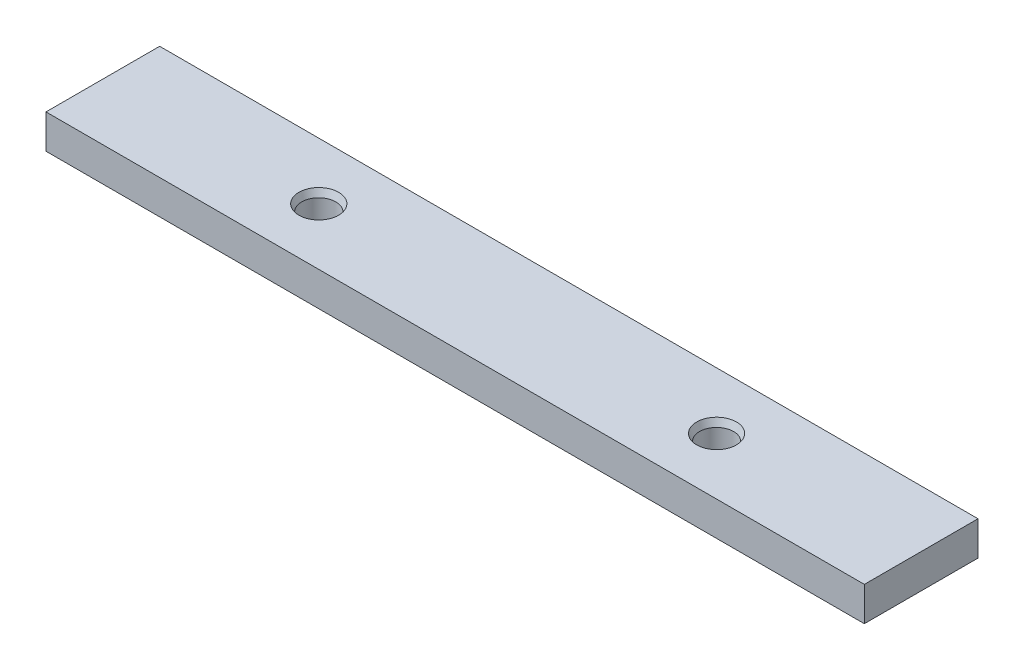
ISO-10303-21;
HEADER;
FILE_DESCRIPTION(('STEP AP214'),'2;1');
FILE_NAME('part.step','',(''),(''),'','','');
FILE_SCHEMA(('AUTOMOTIVE_DESIGN { 1 0 10303 214 1 1 1 1 }'));
ENDSEC;
DATA;
#1=APPLICATION_CONTEXT('core data for automotive mechanical design processes');
#2=APPLICATION_PROTOCOL_DEFINITION('international standard','automotive_design',2000,#1);
#3=PRODUCT_CONTEXT('',#1,'mechanical');
#4=PRODUCT('Part','Part','',(#3));
#5=PRODUCT_RELATED_PRODUCT_CATEGORY('part','',(#4));
#6=PRODUCT_DEFINITION_FORMATION('','',#4);
#7=PRODUCT_DEFINITION_CONTEXT('part definition',#1,'design');
#8=PRODUCT_DEFINITION('design','',#6,#7);
#9=PRODUCT_DEFINITION_SHAPE('','',#8);
#10=(LENGTH_UNIT() NAMED_UNIT(*) SI_UNIT(.MILLI.,.METRE.));
#11=(NAMED_UNIT(*) PLANE_ANGLE_UNIT() SI_UNIT($,.RADIAN.));
#12=(NAMED_UNIT(*) SI_UNIT($,.STERADIAN.) SOLID_ANGLE_UNIT());
#13=UNCERTAINTY_MEASURE_WITH_UNIT(LENGTH_MEASURE(1.E-05),#10,'distance_accuracy_value','');
#14=(GEOMETRIC_REPRESENTATION_CONTEXT(3) GLOBAL_UNCERTAINTY_ASSIGNED_CONTEXT((#13)) GLOBAL_UNIT_ASSIGNED_CONTEXT((#10,
#11,#12)) REPRESENTATION_CONTEXT('',''));
#15=CARTESIAN_POINT('',(0.,0.,0.));
#16=DIRECTION('',(0.,0.,1.));
#17=DIRECTION('',(1.,0.,0.));
#18=AXIS2_PLACEMENT_3D('',#15,#16,#17);
#19=CARTESIAN_POINT('',(0.,6.,0.));
#20=DIRECTION('',(0.,-1.,0.));
#21=DIRECTION('',(0.,0.,-1.));
#22=AXIS2_PLACEMENT_3D('',#19,#20,#21);
#23=PLANE('',#22);
#24=DIRECTION('',(0.,0.,1.));
#25=VECTOR('',#24,1.);
#26=CARTESIAN_POINT('',(0.,6.,0.));
#27=LINE('',#26,#25);
#28=CARTESIAN_POINT('',(0.,6.,-20.));
#29=VERTEX_POINT('',#28);
#30=CARTESIAN_POINT('',(0.,6.,0.));
#31=VERTEX_POINT('',#30);
#32=EDGE_CURVE('E96',#29,#31,#27,.T.);
#33=ORIENTED_EDGE('',*,*,#32,.T.);
#34=DIRECTION('',(1.,0.,0.));
#35=VECTOR('',#34,1.);
#36=CARTESIAN_POINT('',(0.,6.,0.));
#37=LINE('',#36,#35);
#38=CARTESIAN_POINT('',(144.,6.,0.));
#39=VERTEX_POINT('',#38);
#40=EDGE_CURVE('E91',#31,#39,#37,.T.);
#41=ORIENTED_EDGE('',*,*,#40,.T.);
#42=DIRECTION('',(0.,0.,-1.));
#43=VECTOR('',#42,1.);
#44=CARTESIAN_POINT('',(144.,6.,0.));
#45=LINE('',#44,#43);
#46=CARTESIAN_POINT('',(144.,6.,-20.));
#47=VERTEX_POINT('',#46);
#48=EDGE_CURVE('E94',#39,#47,#45,.T.);
#49=ORIENTED_EDGE('',*,*,#48,.T.);
#50=DIRECTION('',(-1.,0.,0.));
#51=VECTOR('',#50,1.);
#52=CARTESIAN_POINT('',(0.,6.,-20.));
#53=LINE('',#52,#51);
#54=EDGE_CURVE('E61',#47,#29,#53,.T.);
#55=ORIENTED_EDGE('',*,*,#54,.T.);
#56=EDGE_LOOP('',(#33,#41,#49,#55));
#57=FACE_BOUND('',#56,.T.);
#58=CARTESIAN_POINT('',(108.,6.,-10.));
#59=DIRECTION('',(0.,1.,0.));
#60=DIRECTION('',(0.,0.,1.));
#61=AXIS2_PLACEMENT_3D('',#58,#59,#60);
#62=CIRCLE('',#61,3.5);
#63=CARTESIAN_POINT('',(108.,6.,-6.5));
#64=VERTEX_POINT('',#63);
#65=EDGE_CURVE('E127',#64,#64,#62,.T.);
#66=ORIENTED_EDGE('',*,*,#65,.F.);
#67=EDGE_LOOP('',(#66));
#68=FACE_BOUND('',#67,.T.);
#69=CARTESIAN_POINT('',(38.,6.,-10.));
#70=DIRECTION('',(0.,1.,0.));
#71=DIRECTION('',(0.,0.,1.));
#72=AXIS2_PLACEMENT_3D('',#69,#70,#71);
#73=CIRCLE('',#72,3.5);
#74=CARTESIAN_POINT('',(38.,6.,-6.5));
#75=VERTEX_POINT('',#74);
#76=EDGE_CURVE('E136',#75,#75,#73,.T.);
#77=ORIENTED_EDGE('',*,*,#76,.F.);
#78=EDGE_LOOP('',(#77));
#79=FACE_BOUND('',#78,.T.);
#80=ADVANCED_FACE('F44',(#57,#68,#79),#23,.F.);
#81=CARTESIAN_POINT('',(0.,6.,0.));
#82=DIRECTION('',(1.,0.,0.));
#83=DIRECTION('',(0.,0.,-1.));
#84=AXIS2_PLACEMENT_3D('',#81,#82,#83);
#85=PLANE('',#84);
#86=DIRECTION('',(0.,0.,1.));
#87=VECTOR('',#86,1.);
#88=CARTESIAN_POINT('',(0.,0.,0.));
#89=LINE('',#88,#87);
#90=CARTESIAN_POINT('',(0.,0.,-20.));
#91=VERTEX_POINT('',#90);
#92=CARTESIAN_POINT('',(0.,0.,0.));
#93=VERTEX_POINT('',#92);
#94=EDGE_CURVE('E108',#91,#93,#89,.T.);
#95=ORIENTED_EDGE('',*,*,#94,.T.);
#96=DIRECTION('',(0.,-1.,0.));
#97=VECTOR('',#96,1.);
#98=CARTESIAN_POINT('',(0.,6.,0.));
#99=LINE('',#98,#97);
#100=EDGE_CURVE('E13',#31,#93,#99,.T.);
#101=ORIENTED_EDGE('',*,*,#100,.F.);
#102=ORIENTED_EDGE('',*,*,#32,.F.);
#103=DIRECTION('',(0.,-1.,0.));
#104=VECTOR('',#103,1.);
#105=CARTESIAN_POINT('',(0.,6.,-20.));
#106=LINE('',#105,#104);
#107=EDGE_CURVE('E104',#29,#91,#106,.T.);
#108=ORIENTED_EDGE('',*,*,#107,.T.);
#109=EDGE_LOOP('',(#95,#101,#102,#108));
#110=FACE_BOUND('',#109,.T.);
#111=ADVANCED_FACE('F46',(#110),#85,.F.);
#112=CARTESIAN_POINT('',(0.,6.,0.));
#113=DIRECTION('',(0.,0.,-1.));
#114=DIRECTION('',(-1.,0.,0.));
#115=AXIS2_PLACEMENT_3D('',#112,#113,#114);
#116=PLANE('',#115);
#117=DIRECTION('',(1.,0.,0.));
#118=VECTOR('',#117,1.);
#119=CARTESIAN_POINT('',(0.,0.,0.));
#120=LINE('',#119,#118);
#121=CARTESIAN_POINT('',(144.,0.,0.));
#122=VERTEX_POINT('',#121);
#123=EDGE_CURVE('E100',#93,#122,#120,.T.);
#124=ORIENTED_EDGE('',*,*,#123,.T.);
#125=DIRECTION('',(0.,-1.,0.));
#126=VECTOR('',#125,1.);
#127=CARTESIAN_POINT('',(144.,6.,0.));
#128=LINE('',#127,#126);
#129=EDGE_CURVE('E53',#39,#122,#128,.T.);
#130=ORIENTED_EDGE('',*,*,#129,.F.);
#131=ORIENTED_EDGE('',*,*,#40,.F.);
#132=ORIENTED_EDGE('',*,*,#100,.T.);
#133=EDGE_LOOP('',(#124,#130,#131,#132));
#134=FACE_BOUND('',#133,.T.);
#135=ADVANCED_FACE('F99',(#134),#116,.F.);
#136=CARTESIAN_POINT('',(144.,6.,0.));
#137=DIRECTION('',(-1.,0.,0.));
#138=DIRECTION('',(0.,0.,1.));
#139=AXIS2_PLACEMENT_3D('',#136,#137,#138);
#140=PLANE('',#139);
#141=DIRECTION('',(0.,0.,-1.));
#142=VECTOR('',#141,1.);
#143=CARTESIAN_POINT('',(144.,0.,0.));
#144=LINE('',#143,#142);
#145=CARTESIAN_POINT('',(144.,0.,-20.));
#146=VERTEX_POINT('',#145);
#147=EDGE_CURVE('E78',#122,#146,#144,.T.);
#148=ORIENTED_EDGE('',*,*,#147,.T.);
#149=DIRECTION('',(0.,-1.,0.));
#150=VECTOR('',#149,1.);
#151=CARTESIAN_POINT('',(144.,6.,-20.));
#152=LINE('',#151,#150);
#153=EDGE_CURVE('E101',#47,#146,#152,.T.);
#154=ORIENTED_EDGE('',*,*,#153,.F.);
#155=ORIENTED_EDGE('',*,*,#48,.F.);
#156=ORIENTED_EDGE('',*,*,#129,.T.);
#157=EDGE_LOOP('',(#148,#154,#155,#156));
#158=FACE_BOUND('',#157,.T.);
#159=ADVANCED_FACE('F102',(#158),#140,.F.);
#160=CARTESIAN_POINT('',(0.,6.,-20.));
#161=DIRECTION('',(0.,0.,1.));
#162=DIRECTION('',(1.,0.,0.));
#163=AXIS2_PLACEMENT_3D('',#160,#161,#162);
#164=PLANE('',#163);
#165=DIRECTION('',(-1.,0.,0.));
#166=VECTOR('',#165,1.);
#167=CARTESIAN_POINT('',(0.,0.,-20.));
#168=LINE('',#167,#166);
#169=EDGE_CURVE('E84',#146,#91,#168,.T.);
#170=ORIENTED_EDGE('',*,*,#169,.T.);
#171=ORIENTED_EDGE('',*,*,#107,.F.);
#172=ORIENTED_EDGE('',*,*,#54,.F.);
#173=ORIENTED_EDGE('',*,*,#153,.T.);
#174=EDGE_LOOP('',(#170,#171,#172,#173));
#175=FACE_BOUND('',#174,.T.);
#176=ADVANCED_FACE('F116',(#175),#164,.F.);
#177=CARTESIAN_POINT('',(0.,0.,0.));
#178=DIRECTION('',(0.,-1.,0.));
#179=DIRECTION('',(0.,0.,-1.));
#180=AXIS2_PLACEMENT_3D('',#177,#178,#179);
#181=PLANE('',#180);
#182=CARTESIAN_POINT('',(38.,0.,-10.));
#183=DIRECTION('',(0.,-1.,0.));
#184=DIRECTION('',(0.,0.,-1.));
#185=AXIS2_PLACEMENT_3D('',#182,#183,#184);
#186=CIRCLE('',#185,2.99999999999999);
#187=CARTESIAN_POINT('',(38.,0.,-13.));
#188=VERTEX_POINT('',#187);
#189=EDGE_CURVE('E130',#188,#188,#186,.T.);
#190=ORIENTED_EDGE('',*,*,#189,.F.);
#191=EDGE_LOOP('',(#190));
#192=FACE_BOUND('',#191,.T.);
#193=CARTESIAN_POINT('',(108.,0.,-10.));
#194=DIRECTION('',(0.,-1.,0.));
#195=DIRECTION('',(0.,0.,-1.));
#196=AXIS2_PLACEMENT_3D('',#193,#194,#195);
#197=CIRCLE('',#196,3.);
#198=CARTESIAN_POINT('',(108.,0.,-13.));
#199=VERTEX_POINT('',#198);
#200=EDGE_CURVE('E111',#199,#199,#197,.T.);
#201=ORIENTED_EDGE('',*,*,#200,.F.);
#202=EDGE_LOOP('',(#201));
#203=FACE_BOUND('',#202,.T.);
#204=ORIENTED_EDGE('',*,*,#94,.F.);
#205=ORIENTED_EDGE('',*,*,#169,.F.);
#206=ORIENTED_EDGE('',*,*,#147,.F.);
#207=ORIENTED_EDGE('',*,*,#123,.F.);
#208=EDGE_LOOP('',(#204,#205,#206,#207));
#209=FACE_BOUND('',#208,.T.);
#210=ADVANCED_FACE('F119',(#192,#203,#209),#181,.T.);
#211=CARTESIAN_POINT('',(108.,6.,-10.));
#212=DIRECTION('',(0.,1.,0.));
#213=DIRECTION('',(0.,0.,1.));
#214=AXIS2_PLACEMENT_3D('',#211,#212,#213);
#215=CYLINDRICAL_SURFACE('',#214,3.);
#216=CARTESIAN_POINT('',(108.,4.79289321881343,-10.));
#217=DIRECTION('',(0.,1.,0.));
#218=DIRECTION('',(0.,0.,1.));
#219=AXIS2_PLACEMENT_3D('',#216,#217,#218);
#220=CIRCLE('',#219,2.99999999999999);
#221=CARTESIAN_POINT('',(108.,4.79289321881343,-7.00000000000001));
#222=VERTEX_POINT('',#221);
#223=EDGE_CURVE('E124',#222,#222,#220,.T.);
#224=ORIENTED_EDGE('',*,*,#223,.T.);
#225=EDGE_LOOP('',(#224));
#226=FACE_BOUND('',#225,.T.);
#227=ORIENTED_EDGE('',*,*,#200,.T.);
#228=EDGE_LOOP('',(#227));
#229=FACE_BOUND('',#228,.T.);
#230=ADVANCED_FACE('F149',(#226,#229),#215,.F.);
#231=CARTESIAN_POINT('',(108.,6.,-10.));
#232=DIRECTION('',(0.,1.,0.));
#233=DIRECTION('',(0.,0.,1.));
#234=AXIS2_PLACEMENT_3D('',#231,#232,#233);
#235=CONICAL_SURFACE('',#234,3.5,0.392699081698726);
#236=ORIENTED_EDGE('',*,*,#223,.F.);
#237=EDGE_LOOP('',(#236));
#238=FACE_BOUND('',#237,.T.);
#239=ORIENTED_EDGE('',*,*,#65,.T.);
#240=EDGE_LOOP('',(#239));
#241=FACE_BOUND('',#240,.T.);
#242=ADVANCED_FACE('F180',(#238,#241),#235,.F.);
#243=CARTESIAN_POINT('',(38.,6.,-10.));
#244=DIRECTION('',(0.,1.,0.));
#245=DIRECTION('',(0.,0.,1.));
#246=AXIS2_PLACEMENT_3D('',#243,#244,#245);
#247=CYLINDRICAL_SURFACE('',#246,2.99999999999999);
#248=CARTESIAN_POINT('',(38.,4.79289321881343,-10.));
#249=DIRECTION('',(0.,1.,0.));
#250=DIRECTION('',(0.,0.,1.));
#251=AXIS2_PLACEMENT_3D('',#248,#249,#250);
#252=CIRCLE('',#251,2.99999999999999);
#253=CARTESIAN_POINT('',(38.,4.79289321881343,-7.00000000000001));
#254=VERTEX_POINT('',#253);
#255=EDGE_CURVE('E133',#254,#254,#252,.T.);
#256=ORIENTED_EDGE('',*,*,#255,.T.);
#257=EDGE_LOOP('',(#256));
#258=FACE_BOUND('',#257,.T.);
#259=ORIENTED_EDGE('',*,*,#189,.T.);
#260=EDGE_LOOP('',(#259));
#261=FACE_BOUND('',#260,.T.);
#262=ADVANCED_FACE('F187',(#258,#261),#247,.F.);
#263=CARTESIAN_POINT('',(38.,6.,-10.));
#264=DIRECTION('',(0.,1.,0.));
#265=DIRECTION('',(0.,0.,1.));
#266=AXIS2_PLACEMENT_3D('',#263,#264,#265);
#267=CONICAL_SURFACE('',#266,3.5,0.392699081698721);
#268=ORIENTED_EDGE('',*,*,#255,.F.);
#269=EDGE_LOOP('',(#268));
#270=FACE_BOUND('',#269,.T.);
#271=ORIENTED_EDGE('',*,*,#76,.T.);
#272=EDGE_LOOP('',(#271));
#273=FACE_BOUND('',#272,.T.);
#274=ADVANCED_FACE('F140',(#270,#273),#267,.F.);
#275=CLOSED_SHELL('',(#80,#111,#135,#159,#176,#210,#230,#242,#262,#274));
#276=MANIFOLD_SOLID_BREP('B2',#275);
#277=ADVANCED_BREP_SHAPE_REPRESENTATION('',(#18,#276),#14);
#278=SHAPE_DEFINITION_REPRESENTATION(#9,#277);
ENDSEC;
END-ISO-10303-21;
